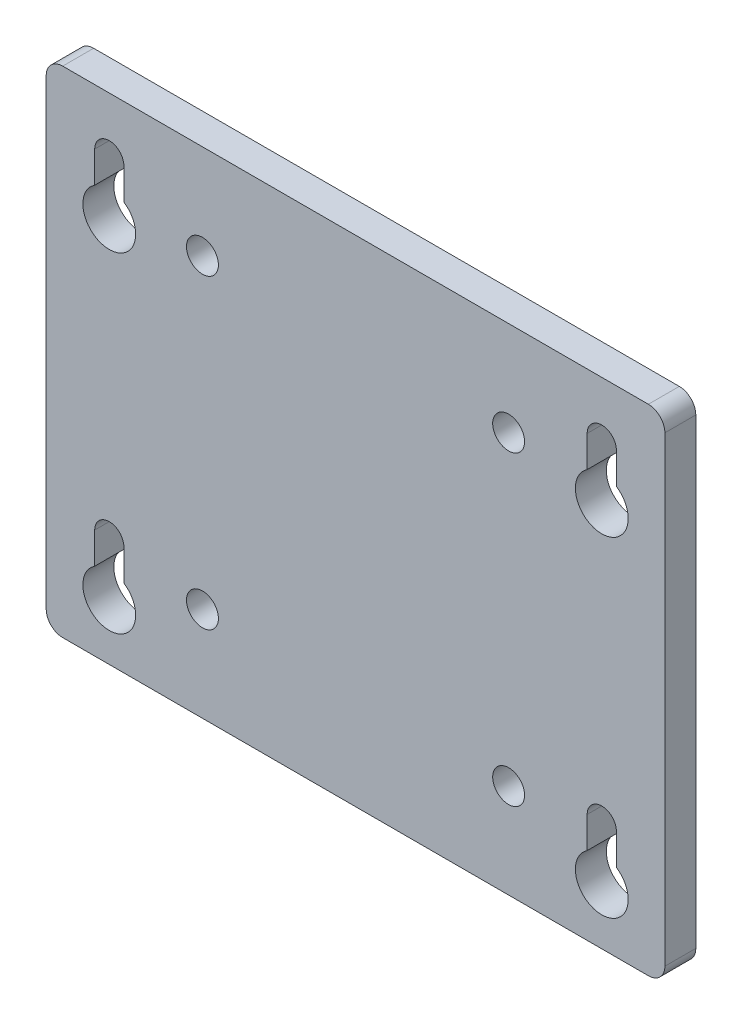
ISO-10303-21;
HEADER;
FILE_DESCRIPTION(('STEP AP214'),'2;1');
FILE_NAME('part.step','',(''),(''),'','','');
FILE_SCHEMA(('AUTOMOTIVE_DESIGN { 1 0 10303 214 1 1 1 1 }'));
ENDSEC;
DATA;
#1=APPLICATION_CONTEXT('core data for automotive mechanical design processes');
#2=APPLICATION_PROTOCOL_DEFINITION('international standard','automotive_design',2000,#1);
#3=PRODUCT_CONTEXT('',#1,'mechanical');
#4=PRODUCT('Part','Part','',(#3));
#5=PRODUCT_RELATED_PRODUCT_CATEGORY('part','',(#4));
#6=PRODUCT_DEFINITION_FORMATION('','',#4);
#7=PRODUCT_DEFINITION_CONTEXT('part definition',#1,'design');
#8=PRODUCT_DEFINITION('design','',#6,#7);
#9=PRODUCT_DEFINITION_SHAPE('','',#8);
#10=(LENGTH_UNIT() NAMED_UNIT(*) SI_UNIT(.MILLI.,.METRE.));
#11=(NAMED_UNIT(*) PLANE_ANGLE_UNIT() SI_UNIT($,.RADIAN.));
#12=(NAMED_UNIT(*) SI_UNIT($,.STERADIAN.) SOLID_ANGLE_UNIT());
#13=UNCERTAINTY_MEASURE_WITH_UNIT(LENGTH_MEASURE(1.E-05),#10,'distance_accuracy_value','');
#14=(GEOMETRIC_REPRESENTATION_CONTEXT(3) GLOBAL_UNCERTAINTY_ASSIGNED_CONTEXT((#13)) GLOBAL_UNIT_ASSIGNED_CONTEXT((#10,
#11,#12)) REPRESENTATION_CONTEXT('',''));
#15=CARTESIAN_POINT('',(0.,0.,0.));
#16=DIRECTION('',(0.,0.,1.));
#17=DIRECTION('',(1.,0.,0.));
#18=AXIS2_PLACEMENT_3D('',#15,#16,#17);
#19=CARTESIAN_POINT('',(0.,0.,0.));
#20=DIRECTION('',(0.,0.,1.));
#21=DIRECTION('',(1.,0.,0.));
#22=AXIS2_PLACEMENT_3D('',#19,#20,#21);
#23=PLANE('',#22);
#24=DIRECTION('',(0.,-1.,0.));
#25=VECTOR('',#24,1.);
#26=CARTESIAN_POINT('',(35.6646,29.5021,0.));
#27=LINE('',#26,#25);
#28=CARTESIAN_POINT('',(35.6646,29.5021,0.));
#29=VERTEX_POINT('',#28);
#30=CARTESIAN_POINT('',(35.6646,24.6836113861049,0.));
#31=VERTEX_POINT('',#30);
#32=EDGE_CURVE('E702',#29,#31,#27,.T.);
#33=ORIENTED_EDGE('',*,*,#32,.T.);
#34=CARTESIAN_POINT('',(37.9125,21.2979,0.));
#35=DIRECTION('',(0.,0.,-1.));
#36=DIRECTION('',(-1.,0.,0.));
#37=AXIS2_PLACEMENT_3D('',#34,#35,#36);
#38=CIRCLE('',#37,4.064);
#39=CARTESIAN_POINT('',(40.1604,24.6836113861049,0.));
#40=VERTEX_POINT('',#39);
#41=EDGE_CURVE('E685',#40,#31,#38,.T.);
#42=ORIENTED_EDGE('',*,*,#41,.F.);
#43=DIRECTION('',(0.,-1.,0.));
#44=VECTOR('',#43,1.);
#45=CARTESIAN_POINT('',(40.1604,29.5021,0.));
#46=LINE('',#45,#44);
#47=CARTESIAN_POINT('',(40.1604,29.5021,0.));
#48=VERTEX_POINT('',#47);
#49=EDGE_CURVE('E693',#48,#40,#46,.T.);
#50=ORIENTED_EDGE('',*,*,#49,.F.);
#51=CARTESIAN_POINT('',(37.9125,29.5021,0.));
#52=DIRECTION('',(0.,0.,-1.));
#53=DIRECTION('',(-1.,0.,0.));
#54=AXIS2_PLACEMENT_3D('',#51,#52,#53);
#55=CIRCLE('',#54,2.2479);
#56=EDGE_CURVE('E708',#29,#48,#55,.T.);
#57=ORIENTED_EDGE('',*,*,#56,.F.);
#58=EDGE_LOOP('',(#33,#42,#50,#57));
#59=FACE_BOUND('',#58,.T.);
#60=DIRECTION('',(0.,1.,0.));
#61=VECTOR('',#60,1.);
#62=CARTESIAN_POINT('',(47.625,-38.1,0.));
#63=LINE('',#62,#61);
#64=CARTESIAN_POINT('',(47.625,-35.56,0.));
#65=VERTEX_POINT('',#64);
#66=CARTESIAN_POINT('',(47.625,35.56,0.));
#67=VERTEX_POINT('',#66);
#68=EDGE_CURVE('E611',#65,#67,#63,.T.);
#69=ORIENTED_EDGE('',*,*,#68,.F.);
#70=CARTESIAN_POINT('',(45.085,-35.56,0.));
#71=DIRECTION('',(0.,0.,1.));
#72=DIRECTION('',(1.,0.,0.));
#73=AXIS2_PLACEMENT_3D('',#70,#71,#72);
#74=CIRCLE('',#73,2.54);
#75=CARTESIAN_POINT('',(45.085,-38.1,0.));
#76=VERTEX_POINT('',#75);
#77=EDGE_CURVE('E626',#65,#76,#74,.F.);
#78=ORIENTED_EDGE('',*,*,#77,.T.);
#79=DIRECTION('',(1.,0.,0.));
#80=VECTOR('',#79,1.);
#81=CARTESIAN_POINT('',(47.625,-38.1,0.));
#82=LINE('',#81,#80);
#83=CARTESIAN_POINT('',(-45.085,-38.1,0.));
#84=VERTEX_POINT('',#83);
#85=EDGE_CURVE('E608',#84,#76,#82,.T.);
#86=ORIENTED_EDGE('',*,*,#85,.F.);
#87=CARTESIAN_POINT('',(-45.085,-35.56,0.));
#88=DIRECTION('',(0.,0.,1.));
#89=DIRECTION('',(1.,0.,0.));
#90=AXIS2_PLACEMENT_3D('',#87,#88,#89);
#91=CIRCLE('',#90,2.54);
#92=CARTESIAN_POINT('',(-47.625,-35.56,0.));
#93=VERTEX_POINT('',#92);
#94=EDGE_CURVE('E624',#84,#93,#91,.F.);
#95=ORIENTED_EDGE('',*,*,#94,.T.);
#96=DIRECTION('',(0.,-1.,0.));
#97=VECTOR('',#96,1.);
#98=CARTESIAN_POINT('',(-47.625,-38.1,0.));
#99=LINE('',#98,#97);
#100=CARTESIAN_POINT('',(-47.625,35.56,0.));
#101=VERTEX_POINT('',#100);
#102=EDGE_CURVE('E591',#101,#93,#99,.T.);
#103=ORIENTED_EDGE('',*,*,#102,.F.);
#104=CARTESIAN_POINT('',(-45.085,35.56,0.));
#105=DIRECTION('',(0.,0.,1.));
#106=DIRECTION('',(1.,0.,0.));
#107=AXIS2_PLACEMENT_3D('',#104,#105,#106);
#108=CIRCLE('',#107,2.54);
#109=CARTESIAN_POINT('',(-45.085,38.1,0.));
#110=VERTEX_POINT('',#109);
#111=EDGE_CURVE('E622',#101,#110,#108,.F.);
#112=ORIENTED_EDGE('',*,*,#111,.T.);
#113=DIRECTION('',(-1.,0.,0.));
#114=VECTOR('',#113,1.);
#115=CARTESIAN_POINT('',(47.625,38.1,0.));
#116=LINE('',#115,#114);
#117=CARTESIAN_POINT('',(45.085,38.1,0.));
#118=VERTEX_POINT('',#117);
#119=EDGE_CURVE('E596',#118,#110,#116,.T.);
#120=ORIENTED_EDGE('',*,*,#119,.F.);
#121=CARTESIAN_POINT('',(45.085,35.56,0.));
#122=DIRECTION('',(0.,0.,1.));
#123=DIRECTION('',(1.,0.,0.));
#124=AXIS2_PLACEMENT_3D('',#121,#122,#123);
#125=CIRCLE('',#124,2.54);
#126=EDGE_CURVE('E620',#118,#67,#125,.F.);
#127=ORIENTED_EDGE('',*,*,#126,.T.);
#128=EDGE_LOOP('',(#69,#78,#86,#95,#103,#112,#120,#127));
#129=FACE_BOUND('',#128,.T.);
#130=CARTESIAN_POINT('',(23.57,-23.57,0.));
#131=DIRECTION('',(0.,0.,1.));
#132=DIRECTION('',(1.,0.,0.));
#133=AXIS2_PLACEMENT_3D('',#130,#131,#132);
#134=CIRCLE('',#133,2.45745);
#135=CARTESIAN_POINT('',(26.02745,-23.57,0.));
#136=VERTEX_POINT('',#135);
#137=EDGE_CURVE('E588',#136,#136,#134,.T.);
#138=ORIENTED_EDGE('',*,*,#137,.T.);
#139=EDGE_LOOP('',(#138));
#140=FACE_BOUND('',#139,.T.);
#141=CARTESIAN_POINT('',(-23.57,-23.57,0.));
#142=DIRECTION('',(0.,0.,1.));
#143=DIRECTION('',(1.,0.,0.));
#144=AXIS2_PLACEMENT_3D('',#141,#142,#143);
#145=CIRCLE('',#144,2.45745);
#146=CARTESIAN_POINT('',(-21.11255,-23.57,0.));
#147=VERTEX_POINT('',#146);
#148=EDGE_CURVE('E582',#147,#147,#145,.T.);
#149=ORIENTED_EDGE('',*,*,#148,.T.);
#150=EDGE_LOOP('',(#149));
#151=FACE_BOUND('',#150,.T.);
#152=CARTESIAN_POINT('',(-23.57,23.57,0.));
#153=DIRECTION('',(0.,0.,1.));
#154=DIRECTION('',(1.,0.,0.));
#155=AXIS2_PLACEMENT_3D('',#152,#153,#154);
#156=CIRCLE('',#155,2.45745);
#157=CARTESIAN_POINT('',(-21.11255,23.57,0.));
#158=VERTEX_POINT('',#157);
#159=EDGE_CURVE('E576',#158,#158,#156,.T.);
#160=ORIENTED_EDGE('',*,*,#159,.T.);
#161=EDGE_LOOP('',(#160));
#162=FACE_BOUND('',#161,.T.);
#163=CARTESIAN_POINT('',(23.57,23.57,0.));
#164=DIRECTION('',(0.,0.,1.));
#165=DIRECTION('',(1.,0.,0.));
#166=AXIS2_PLACEMENT_3D('',#163,#164,#165);
#167=CIRCLE('',#166,2.45745);
#168=CARTESIAN_POINT('',(26.02745,23.57,0.));
#169=VERTEX_POINT('',#168);
#170=EDGE_CURVE('E570',#169,#169,#167,.T.);
#171=ORIENTED_EDGE('',*,*,#170,.T.);
#172=EDGE_LOOP('',(#171));
#173=FACE_BOUND('',#172,.T.);
#174=DIRECTION('',(0.,-1.,0.));
#175=VECTOR('',#174,1.);
#176=CARTESIAN_POINT('',(-40.1604,29.5021,0.));
#177=LINE('',#176,#175);
#178=CARTESIAN_POINT('',(-40.1604,29.5021,0.));
#179=VERTEX_POINT('',#178);
#180=CARTESIAN_POINT('',(-40.1604,24.6836113861049,0.));
#181=VERTEX_POINT('',#180);
#182=EDGE_CURVE('E553',#179,#181,#177,.T.);
#183=ORIENTED_EDGE('',*,*,#182,.T.);
#184=CARTESIAN_POINT('',(-37.9125,21.2979,0.));
#185=DIRECTION('',(0.,0.,-1.));
#186=DIRECTION('',(1.,0.,0.));
#187=AXIS2_PLACEMENT_3D('',#184,#185,#186);
#188=CIRCLE('',#187,4.064);
#189=CARTESIAN_POINT('',(-35.6646,24.6836113861049,0.));
#190=VERTEX_POINT('',#189);
#191=EDGE_CURVE('E504',#190,#181,#188,.T.);
#192=ORIENTED_EDGE('',*,*,#191,.F.);
#193=DIRECTION('',(0.,-1.,0.));
#194=VECTOR('',#193,1.);
#195=CARTESIAN_POINT('',(-35.6646,29.5021,0.));
#196=LINE('',#195,#194);
#197=CARTESIAN_POINT('',(-35.6646,29.5021,0.));
#198=VERTEX_POINT('',#197);
#199=EDGE_CURVE('E544',#198,#190,#196,.T.);
#200=ORIENTED_EDGE('',*,*,#199,.F.);
#201=CARTESIAN_POINT('',(-37.9125,29.5021,0.));
#202=DIRECTION('',(0.,0.,-1.));
#203=DIRECTION('',(-1.,0.,0.));
#204=AXIS2_PLACEMENT_3D('',#201,#202,#203);
#205=CIRCLE('',#204,2.2479);
#206=EDGE_CURVE('E559',#179,#198,#205,.T.);
#207=ORIENTED_EDGE('',*,*,#206,.F.);
#208=EDGE_LOOP('',(#183,#192,#200,#207));
#209=FACE_BOUND('',#208,.T.);
#210=DIRECTION('',(0.,-1.,0.));
#211=VECTOR('',#210,1.);
#212=CARTESIAN_POINT('',(-40.1604,-21.2979,0.));
#213=LINE('',#212,#211);
#214=CARTESIAN_POINT('',(-40.1604,-21.2979,0.));
#215=VERTEX_POINT('',#214);
#216=CARTESIAN_POINT('',(-40.1604,-26.1163886138951,0.));
#217=VERTEX_POINT('',#216);
#218=EDGE_CURVE('E530',#215,#217,#213,.T.);
#219=ORIENTED_EDGE('',*,*,#218,.T.);
#220=CARTESIAN_POINT('',(-37.9125,-29.5021,0.));
#221=DIRECTION('',(0.,0.,-1.));
#222=DIRECTION('',(-1.,0.,0.));
#223=AXIS2_PLACEMENT_3D('',#220,#221,#222);
#224=CIRCLE('',#223,4.06400000000001);
#225=CARTESIAN_POINT('',(-35.6646,-26.1163886138952,0.));
#226=VERTEX_POINT('',#225);
#227=EDGE_CURVE('E677',#226,#217,#224,.T.);
#228=ORIENTED_EDGE('',*,*,#227,.F.);
#229=DIRECTION('',(0.,-1.,0.));
#230=VECTOR('',#229,1.);
#231=CARTESIAN_POINT('',(-35.6646,-21.2979,0.));
#232=LINE('',#231,#230);
#233=CARTESIAN_POINT('',(-35.6646,-21.2979,0.));
#234=VERTEX_POINT('',#233);
#235=EDGE_CURVE('E521',#234,#226,#232,.T.);
#236=ORIENTED_EDGE('',*,*,#235,.F.);
#237=CARTESIAN_POINT('',(-37.9125,-21.2979,0.));
#238=DIRECTION('',(0.,0.,-1.));
#239=DIRECTION('',(-1.,0.,0.));
#240=AXIS2_PLACEMENT_3D('',#237,#238,#239);
#241=CIRCLE('',#240,2.2479);
#242=EDGE_CURVE('E536',#215,#234,#241,.T.);
#243=ORIENTED_EDGE('',*,*,#242,.F.);
#244=EDGE_LOOP('',(#219,#228,#236,#243));
#245=FACE_BOUND('',#244,.T.);
#246=DIRECTION('',(0.,-1.,0.));
#247=VECTOR('',#246,1.);
#248=CARTESIAN_POINT('',(35.6646,-21.2979,0.));
#249=LINE('',#248,#247);
#250=CARTESIAN_POINT('',(35.6646,-21.2979,0.));
#251=VERTEX_POINT('',#250);
#252=CARTESIAN_POINT('',(35.6646,-26.1163886138952,0.));
#253=VERTEX_POINT('',#252);
#254=EDGE_CURVE('E500',#251,#253,#249,.T.);
#255=ORIENTED_EDGE('',*,*,#254,.T.);
#256=CARTESIAN_POINT('',(37.9125,-29.5021,0.));
#257=DIRECTION('',(0.,0.,-1.));
#258=DIRECTION('',(1.,0.,0.));
#259=AXIS2_PLACEMENT_3D('',#256,#257,#258);
#260=CIRCLE('',#259,4.06400000000001);
#261=CARTESIAN_POINT('',(40.1604,-26.1163886138952,0.));
#262=VERTEX_POINT('',#261);
#263=EDGE_CURVE('E487',#262,#253,#260,.T.);
#264=ORIENTED_EDGE('',*,*,#263,.F.);
#265=DIRECTION('',(0.,-1.,0.));
#266=VECTOR('',#265,1.);
#267=CARTESIAN_POINT('',(40.1604,-21.2979,0.));
#268=LINE('',#267,#266);
#269=CARTESIAN_POINT('',(40.1604,-21.2979,0.));
#270=VERTEX_POINT('',#269);
#271=EDGE_CURVE('E716',#270,#262,#268,.T.);
#272=ORIENTED_EDGE('',*,*,#271,.F.);
#273=CARTESIAN_POINT('',(37.9125,-21.2979,0.));
#274=DIRECTION('',(0.,0.,-1.));
#275=DIRECTION('',(-1.,0.,0.));
#276=AXIS2_PLACEMENT_3D('',#273,#274,#275);
#277=CIRCLE('',#276,2.2479);
#278=EDGE_CURVE('E506',#251,#270,#277,.T.);
#279=ORIENTED_EDGE('',*,*,#278,.F.);
#280=EDGE_LOOP('',(#255,#264,#272,#279));
#281=FACE_BOUND('',#280,.T.);
#282=ADVANCED_FACE('F329',(#59,#129,#140,#151,#162,#173,#209,#245,#281),#23,.F.);
#283=CARTESIAN_POINT('',(-47.625,-38.1,4.7625));
#284=DIRECTION('',(1.,0.,0.));
#285=DIRECTION('',(0.,0.,-1.));
#286=AXIS2_PLACEMENT_3D('',#283,#284,#285);
#287=PLANE('',#286);
#288=ORIENTED_EDGE('',*,*,#102,.T.);
#289=DIRECTION('',(0.,0.,-1.));
#290=VECTOR('',#289,1.);
#291=CARTESIAN_POINT('',(-47.625,-35.56,4.7625));
#292=LINE('',#291,#290);
#293=CARTESIAN_POINT('',(-47.625,-35.56,4.7625));
#294=VERTEX_POINT('',#293);
#295=EDGE_CURVE('E644',#93,#294,#292,.F.);
#296=ORIENTED_EDGE('',*,*,#295,.T.);
#297=DIRECTION('',(0.,-1.,0.));
#298=VECTOR('',#297,1.);
#299=CARTESIAN_POINT('',(-47.625,-38.1,4.7625));
#300=LINE('',#299,#298);
#301=CARTESIAN_POINT('',(-47.625,35.56,4.7625));
#302=VERTEX_POINT('',#301);
#303=EDGE_CURVE('E592',#302,#294,#300,.T.);
#304=ORIENTED_EDGE('',*,*,#303,.F.);
#305=DIRECTION('',(0.,0.,-1.));
#306=VECTOR('',#305,1.);
#307=CARTESIAN_POINT('',(-47.625,35.56,4.7625));
#308=LINE('',#307,#306);
#309=EDGE_CURVE('E641',#302,#101,#308,.T.);
#310=ORIENTED_EDGE('',*,*,#309,.T.);
#311=EDGE_LOOP('',(#288,#296,#304,#310));
#312=FACE_BOUND('',#311,.T.);
#313=ADVANCED_FACE('F737',(#312),#287,.F.);
#314=CARTESIAN_POINT('',(47.625,-38.1,4.7625));
#315=DIRECTION('',(0.,1.,0.));
#316=DIRECTION('',(-1.,0.,0.));
#317=AXIS2_PLACEMENT_3D('',#314,#315,#316);
#318=PLANE('',#317);
#319=ORIENTED_EDGE('',*,*,#85,.T.);
#320=DIRECTION('',(0.,0.,-1.));
#321=VECTOR('',#320,1.);
#322=CARTESIAN_POINT('',(45.085,-38.1,4.7625));
#323=LINE('',#322,#321);
#324=CARTESIAN_POINT('',(45.085,-38.1,4.7625));
#325=VERTEX_POINT('',#324);
#326=EDGE_CURVE('E631',#76,#325,#323,.F.);
#327=ORIENTED_EDGE('',*,*,#326,.T.);
#328=DIRECTION('',(1.,0.,0.));
#329=VECTOR('',#328,1.);
#330=CARTESIAN_POINT('',(47.625,-38.1,4.7625));
#331=LINE('',#330,#329);
#332=CARTESIAN_POINT('',(-45.085,-38.1,4.7625));
#333=VERTEX_POINT('',#332);
#334=EDGE_CURVE('E595',#333,#325,#331,.T.);
#335=ORIENTED_EDGE('',*,*,#334,.F.);
#336=DIRECTION('',(0.,0.,-1.));
#337=VECTOR('',#336,1.);
#338=CARTESIAN_POINT('',(-45.085,-38.1,4.7625));
#339=LINE('',#338,#337);
#340=EDGE_CURVE('E628',#333,#84,#339,.T.);
#341=ORIENTED_EDGE('',*,*,#340,.T.);
#342=EDGE_LOOP('',(#319,#327,#335,#341));
#343=FACE_BOUND('',#342,.T.);
#344=ADVANCED_FACE('F743',(#343),#318,.F.);
#345=CARTESIAN_POINT('',(47.625,-38.1,4.7625));
#346=DIRECTION('',(-1.,0.,0.));
#347=DIRECTION('',(0.,0.,1.));
#348=AXIS2_PLACEMENT_3D('',#345,#346,#347);
#349=PLANE('',#348);
#350=DIRECTION('',(0.,1.,0.));
#351=VECTOR('',#350,1.);
#352=CARTESIAN_POINT('',(47.625,-38.1,4.7625));
#353=LINE('',#352,#351);
#354=CARTESIAN_POINT('',(47.625,-35.56,4.7625));
#355=VERTEX_POINT('',#354);
#356=CARTESIAN_POINT('',(47.625,35.56,4.7625));
#357=VERTEX_POINT('',#356);
#358=EDGE_CURVE('E599',#355,#357,#353,.T.);
#359=ORIENTED_EDGE('',*,*,#358,.F.);
#360=DIRECTION('',(0.,0.,-1.));
#361=VECTOR('',#360,1.);
#362=CARTESIAN_POINT('',(47.625,-35.56,4.7625));
#363=LINE('',#362,#361);
#364=EDGE_CURVE('E617',#355,#65,#363,.T.);
#365=ORIENTED_EDGE('',*,*,#364,.T.);
#366=ORIENTED_EDGE('',*,*,#68,.T.);
#367=DIRECTION('',(0.,0.,-1.));
#368=VECTOR('',#367,1.);
#369=CARTESIAN_POINT('',(47.625,35.56,4.7625));
#370=LINE('',#369,#368);
#371=EDGE_CURVE('E605',#67,#357,#370,.F.);
#372=ORIENTED_EDGE('',*,*,#371,.T.);
#373=EDGE_LOOP('',(#359,#365,#366,#372));
#374=FACE_BOUND('',#373,.T.);
#375=ADVANCED_FACE('F753',(#374),#349,.F.);
#376=CARTESIAN_POINT('',(47.625,38.1,4.7625));
#377=DIRECTION('',(0.,-1.,0.));
#378=DIRECTION('',(1.,0.,0.));
#379=AXIS2_PLACEMENT_3D('',#376,#377,#378);
#380=PLANE('',#379);
#381=ORIENTED_EDGE('',*,*,#119,.T.);
#382=DIRECTION('',(0.,0.,-1.));
#383=VECTOR('',#382,1.);
#384=CARTESIAN_POINT('',(-45.085,38.1,4.7625));
#385=LINE('',#384,#383);
#386=CARTESIAN_POINT('',(-45.085,38.1,4.7625));
#387=VERTEX_POINT('',#386);
#388=EDGE_CURVE('E649',#110,#387,#385,.F.);
#389=ORIENTED_EDGE('',*,*,#388,.T.);
#390=DIRECTION('',(-1.,0.,0.));
#391=VECTOR('',#390,1.);
#392=CARTESIAN_POINT('',(47.625,38.1,4.7625));
#393=LINE('',#392,#391);
#394=CARTESIAN_POINT('',(45.085,38.1,4.7625));
#395=VERTEX_POINT('',#394);
#396=EDGE_CURVE('E602',#395,#387,#393,.T.);
#397=ORIENTED_EDGE('',*,*,#396,.F.);
#398=DIRECTION('',(0.,0.,-1.));
#399=VECTOR('',#398,1.);
#400=CARTESIAN_POINT('',(45.085,38.1,4.7625));
#401=LINE('',#400,#399);
#402=EDGE_CURVE('E646',#395,#118,#401,.T.);
#403=ORIENTED_EDGE('',*,*,#402,.T.);
#404=EDGE_LOOP('',(#381,#389,#397,#403));
#405=FACE_BOUND('',#404,.T.);
#406=ADVANCED_FACE('F750',(#405),#380,.F.);
#407=CARTESIAN_POINT('',(0.,0.,4.7625));
#408=DIRECTION('',(0.,0.,1.));
#409=DIRECTION('',(1.,0.,0.));
#410=AXIS2_PLACEMENT_3D('',#407,#408,#409);
#411=PLANE('',#410);
#412=CARTESIAN_POINT('',(37.9125,-29.5021,4.7625));
#413=DIRECTION('',(0.,0.,-1.));
#414=DIRECTION('',(1.,0.,0.));
#415=AXIS2_PLACEMENT_3D('',#412,#413,#414);
#416=CIRCLE('',#415,4.06400000000001);
#417=CARTESIAN_POINT('',(40.1604,-26.1163886138952,4.7625));
#418=VERTEX_POINT('',#417);
#419=CARTESIAN_POINT('',(35.6646,-26.1163886138952,4.7625));
#420=VERTEX_POINT('',#419);
#421=EDGE_CURVE('E344',#418,#420,#416,.T.);
#422=ORIENTED_EDGE('',*,*,#421,.T.);
#423=DIRECTION('',(0.,-1.,0.));
#424=VECTOR('',#423,1.);
#425=CARTESIAN_POINT('',(35.6646,-21.2979,4.7625));
#426=LINE('',#425,#424);
#427=CARTESIAN_POINT('',(35.6646,-21.2979,4.7625));
#428=VERTEX_POINT('',#427);
#429=EDGE_CURVE('E503',#428,#420,#426,.T.);
#430=ORIENTED_EDGE('',*,*,#429,.F.);
#431=CARTESIAN_POINT('',(37.9125,-21.2979,4.7625));
#432=DIRECTION('',(0.,0.,-1.));
#433=DIRECTION('',(-1.,0.,0.));
#434=AXIS2_PLACEMENT_3D('',#431,#432,#433);
#435=CIRCLE('',#434,2.2479);
#436=CARTESIAN_POINT('',(40.1604,-21.2979,4.7625));
#437=VERTEX_POINT('',#436);
#438=EDGE_CURVE('E516',#428,#437,#435,.T.);
#439=ORIENTED_EDGE('',*,*,#438,.T.);
#440=DIRECTION('',(0.,-1.,0.));
#441=VECTOR('',#440,1.);
#442=CARTESIAN_POINT('',(40.1604,-21.2979,4.7625));
#443=LINE('',#442,#441);
#444=EDGE_CURVE('E511',#437,#418,#443,.T.);
#445=ORIENTED_EDGE('',*,*,#444,.T.);
#446=EDGE_LOOP('',(#422,#430,#439,#445));
#447=FACE_BOUND('',#446,.T.);
#448=CARTESIAN_POINT('',(-37.9125,21.2979,4.7625));
#449=DIRECTION('',(0.,0.,-1.));
#450=DIRECTION('',(1.,0.,0.));
#451=AXIS2_PLACEMENT_3D('',#448,#449,#450);
#452=CIRCLE('',#451,4.064);
#453=CARTESIAN_POINT('',(-35.6646,24.6836113861049,4.7625));
#454=VERTEX_POINT('',#453);
#455=CARTESIAN_POINT('',(-40.1604,24.6836113861049,4.7625));
#456=VERTEX_POINT('',#455);
#457=EDGE_CURVE('E351',#454,#456,#452,.T.);
#458=ORIENTED_EDGE('',*,*,#457,.T.);
#459=DIRECTION('',(0.,-1.,0.));
#460=VECTOR('',#459,1.);
#461=CARTESIAN_POINT('',(-40.1604,29.5021,4.7625));
#462=LINE('',#461,#460);
#463=CARTESIAN_POINT('',(-40.1604,29.5021,4.7625));
#464=VERTEX_POINT('',#463);
#465=EDGE_CURVE('E550',#464,#456,#462,.T.);
#466=ORIENTED_EDGE('',*,*,#465,.F.);
#467=CARTESIAN_POINT('',(-37.9125,29.5021,4.7625));
#468=DIRECTION('',(0.,0.,-1.));
#469=DIRECTION('',(-1.,0.,0.));
#470=AXIS2_PLACEMENT_3D('',#467,#468,#469);
#471=CIRCLE('',#470,2.2479);
#472=CARTESIAN_POINT('',(-35.6646,29.5021,4.7625));
#473=VERTEX_POINT('',#472);
#474=EDGE_CURVE('E562',#464,#473,#471,.T.);
#475=ORIENTED_EDGE('',*,*,#474,.T.);
#476=DIRECTION('',(0.,-1.,0.));
#477=VECTOR('',#476,1.);
#478=CARTESIAN_POINT('',(-35.6646,29.5021,4.7625));
#479=LINE('',#478,#477);
#480=EDGE_CURVE('E547',#473,#454,#479,.T.);
#481=ORIENTED_EDGE('',*,*,#480,.T.);
#482=EDGE_LOOP('',(#458,#466,#475,#481));
#483=FACE_BOUND('',#482,.T.);
#484=CARTESIAN_POINT('',(-37.9125,-29.5021,4.7625));
#485=DIRECTION('',(0.,0.,-1.));
#486=DIRECTION('',(-1.,0.,0.));
#487=AXIS2_PLACEMENT_3D('',#484,#485,#486);
#488=CIRCLE('',#487,4.06400000000001);
#489=CARTESIAN_POINT('',(-35.6646,-26.1163886138952,4.7625));
#490=VERTEX_POINT('',#489);
#491=CARTESIAN_POINT('',(-40.1604,-26.1163886138951,4.7625));
#492=VERTEX_POINT('',#491);
#493=EDGE_CURVE('E678',#490,#492,#488,.T.);
#494=ORIENTED_EDGE('',*,*,#493,.T.);
#495=DIRECTION('',(0.,-1.,0.));
#496=VECTOR('',#495,1.);
#497=CARTESIAN_POINT('',(-40.1604,-21.2979,4.7625));
#498=LINE('',#497,#496);
#499=CARTESIAN_POINT('',(-40.1604,-21.2979,4.7625));
#500=VERTEX_POINT('',#499);
#501=EDGE_CURVE('E527',#500,#492,#498,.T.);
#502=ORIENTED_EDGE('',*,*,#501,.F.);
#503=CARTESIAN_POINT('',(-37.9125,-21.2979,4.7625));
#504=DIRECTION('',(0.,0.,-1.));
#505=DIRECTION('',(-1.,0.,0.));
#506=AXIS2_PLACEMENT_3D('',#503,#504,#505);
#507=CIRCLE('',#506,2.2479);
#508=CARTESIAN_POINT('',(-35.6646,-21.2979,4.7625));
#509=VERTEX_POINT('',#508);
#510=EDGE_CURVE('E539',#500,#509,#507,.T.);
#511=ORIENTED_EDGE('',*,*,#510,.T.);
#512=DIRECTION('',(0.,-1.,0.));
#513=VECTOR('',#512,1.);
#514=CARTESIAN_POINT('',(-35.6646,-21.2979,4.7625));
#515=LINE('',#514,#513);
#516=EDGE_CURVE('E524',#509,#490,#515,.T.);
#517=ORIENTED_EDGE('',*,*,#516,.T.);
#518=EDGE_LOOP('',(#494,#502,#511,#517));
#519=FACE_BOUND('',#518,.T.);
#520=CARTESIAN_POINT('',(37.9125,21.2979,4.7625));
#521=DIRECTION('',(0.,0.,-1.));
#522=DIRECTION('',(-1.,0.,0.));
#523=AXIS2_PLACEMENT_3D('',#520,#521,#522);
#524=CIRCLE('',#523,4.064);
#525=CARTESIAN_POINT('',(40.1604,24.6836113861049,4.7625));
#526=VERTEX_POINT('',#525);
#527=CARTESIAN_POINT('',(35.6646,24.6836113861049,4.7625));
#528=VERTEX_POINT('',#527);
#529=EDGE_CURVE('E686',#526,#528,#524,.T.);
#530=ORIENTED_EDGE('',*,*,#529,.T.);
#531=DIRECTION('',(0.,-1.,0.));
#532=VECTOR('',#531,1.);
#533=CARTESIAN_POINT('',(35.6646,29.5021,4.7625));
#534=LINE('',#533,#532);
#535=CARTESIAN_POINT('',(35.6646,29.5021,4.7625));
#536=VERTEX_POINT('',#535);
#537=EDGE_CURVE('E699',#536,#528,#534,.T.);
#538=ORIENTED_EDGE('',*,*,#537,.F.);
#539=CARTESIAN_POINT('',(37.9125,29.5021,4.7625));
#540=DIRECTION('',(0.,0.,-1.));
#541=DIRECTION('',(-1.,0.,0.));
#542=AXIS2_PLACEMENT_3D('',#539,#540,#541);
#543=CIRCLE('',#542,2.2479);
#544=CARTESIAN_POINT('',(40.1604,29.5021,4.7625));
#545=VERTEX_POINT('',#544);
#546=EDGE_CURVE('E711',#536,#545,#543,.T.);
#547=ORIENTED_EDGE('',*,*,#546,.T.);
#548=DIRECTION('',(0.,-1.,0.));
#549=VECTOR('',#548,1.);
#550=CARTESIAN_POINT('',(40.1604,29.5021,4.7625));
#551=LINE('',#550,#549);
#552=EDGE_CURVE('E696',#545,#526,#551,.T.);
#553=ORIENTED_EDGE('',*,*,#552,.T.);
#554=EDGE_LOOP('',(#530,#538,#547,#553));
#555=FACE_BOUND('',#554,.T.);
#556=CARTESIAN_POINT('',(23.57,23.57,4.7625));
#557=DIRECTION('',(0.,0.,1.));
#558=DIRECTION('',(1.,0.,0.));
#559=AXIS2_PLACEMENT_3D('',#556,#557,#558);
#560=CIRCLE('',#559,2.45745);
#561=CARTESIAN_POINT('',(26.02745,23.57,4.7625));
#562=VERTEX_POINT('',#561);
#563=EDGE_CURVE('E567',#562,#562,#560,.T.);
#564=ORIENTED_EDGE('',*,*,#563,.F.);
#565=EDGE_LOOP('',(#564));
#566=FACE_BOUND('',#565,.T.);
#567=CARTESIAN_POINT('',(-23.57,23.57,4.7625));
#568=DIRECTION('',(0.,0.,1.));
#569=DIRECTION('',(1.,0.,0.));
#570=AXIS2_PLACEMENT_3D('',#567,#568,#569);
#571=CIRCLE('',#570,2.45745);
#572=CARTESIAN_POINT('',(-21.11255,23.57,4.7625));
#573=VERTEX_POINT('',#572);
#574=EDGE_CURVE('E573',#573,#573,#571,.T.);
#575=ORIENTED_EDGE('',*,*,#574,.F.);
#576=EDGE_LOOP('',(#575));
#577=FACE_BOUND('',#576,.T.);
#578=CARTESIAN_POINT('',(-23.57,-23.57,4.7625));
#579=DIRECTION('',(0.,0.,1.));
#580=DIRECTION('',(1.,0.,0.));
#581=AXIS2_PLACEMENT_3D('',#578,#579,#580);
#582=CIRCLE('',#581,2.45745);
#583=CARTESIAN_POINT('',(-21.11255,-23.57,4.7625));
#584=VERTEX_POINT('',#583);
#585=EDGE_CURVE('E579',#584,#584,#582,.T.);
#586=ORIENTED_EDGE('',*,*,#585,.F.);
#587=EDGE_LOOP('',(#586));
#588=FACE_BOUND('',#587,.T.);
#589=CARTESIAN_POINT('',(23.57,-23.57,4.7625));
#590=DIRECTION('',(0.,0.,1.));
#591=DIRECTION('',(1.,0.,0.));
#592=AXIS2_PLACEMENT_3D('',#589,#590,#591);
#593=CIRCLE('',#592,2.45745);
#594=CARTESIAN_POINT('',(26.02745,-23.57,4.7625));
#595=VERTEX_POINT('',#594);
#596=EDGE_CURVE('E585',#595,#595,#593,.T.);
#597=ORIENTED_EDGE('',*,*,#596,.F.);
#598=EDGE_LOOP('',(#597));
#599=FACE_BOUND('',#598,.T.);
#600=ORIENTED_EDGE('',*,*,#334,.T.);
#601=CARTESIAN_POINT('',(45.085,-35.56,4.7625));
#602=DIRECTION('',(0.,0.,1.));
#603=DIRECTION('',(1.,0.,0.));
#604=AXIS2_PLACEMENT_3D('',#601,#602,#603);
#605=CIRCLE('',#604,2.54);
#606=EDGE_CURVE('E639',#325,#355,#605,.T.);
#607=ORIENTED_EDGE('',*,*,#606,.T.);
#608=ORIENTED_EDGE('',*,*,#358,.T.);
#609=CARTESIAN_POINT('',(45.085,35.56,4.7625));
#610=DIRECTION('',(0.,0.,1.));
#611=DIRECTION('',(1.,0.,0.));
#612=AXIS2_PLACEMENT_3D('',#609,#610,#611);
#613=CIRCLE('',#612,2.54);
#614=EDGE_CURVE('E633',#357,#395,#613,.T.);
#615=ORIENTED_EDGE('',*,*,#614,.T.);
#616=ORIENTED_EDGE('',*,*,#396,.T.);
#617=CARTESIAN_POINT('',(-45.085,35.56,4.7625));
#618=DIRECTION('',(0.,0.,1.));
#619=DIRECTION('',(1.,0.,0.));
#620=AXIS2_PLACEMENT_3D('',#617,#618,#619);
#621=CIRCLE('',#620,2.54);
#622=EDGE_CURVE('E635',#387,#302,#621,.T.);
#623=ORIENTED_EDGE('',*,*,#622,.T.);
#624=ORIENTED_EDGE('',*,*,#303,.T.);
#625=CARTESIAN_POINT('',(-45.085,-35.56,4.7625));
#626=DIRECTION('',(0.,0.,1.));
#627=DIRECTION('',(1.,0.,0.));
#628=AXIS2_PLACEMENT_3D('',#625,#626,#627);
#629=CIRCLE('',#628,2.54);
#630=EDGE_CURVE('E637',#294,#333,#629,.T.);
#631=ORIENTED_EDGE('',*,*,#630,.T.);
#632=EDGE_LOOP('',(#600,#607,#608,#615,#616,#623,#624,#631));
#633=FACE_BOUND('',#632,.T.);
#634=ADVANCED_FACE('F661',(#447,#483,#519,#555,#566,#577,#588,#599,#633),#411,.T.);
#635=CARTESIAN_POINT('',(23.57,-23.57,4.7625));
#636=DIRECTION('',(0.,0.,1.));
#637=DIRECTION('',(1.,0.,0.));
#638=AXIS2_PLACEMENT_3D('',#635,#636,#637);
#639=CYLINDRICAL_SURFACE('',#638,2.45745);
#640=ORIENTED_EDGE('',*,*,#137,.F.);
#641=EDGE_LOOP('',(#640));
#642=FACE_BOUND('',#641,.T.);
#643=ORIENTED_EDGE('',*,*,#596,.T.);
#644=EDGE_LOOP('',(#643));
#645=FACE_BOUND('',#644,.T.);
#646=ADVANCED_FACE('F814',(#642,#645),#639,.F.);
#647=CARTESIAN_POINT('',(-23.57,-23.57,4.7625));
#648=DIRECTION('',(0.,0.,1.));
#649=DIRECTION('',(1.,0.,0.));
#650=AXIS2_PLACEMENT_3D('',#647,#648,#649);
#651=CYLINDRICAL_SURFACE('',#650,2.45745);
#652=ORIENTED_EDGE('',*,*,#148,.F.);
#653=EDGE_LOOP('',(#652));
#654=FACE_BOUND('',#653,.T.);
#655=ORIENTED_EDGE('',*,*,#585,.T.);
#656=EDGE_LOOP('',(#655));
#657=FACE_BOUND('',#656,.T.);
#658=ADVANCED_FACE('F822',(#654,#657),#651,.F.);
#659=CARTESIAN_POINT('',(-23.57,23.57,4.7625));
#660=DIRECTION('',(0.,0.,1.));
#661=DIRECTION('',(1.,0.,0.));
#662=AXIS2_PLACEMENT_3D('',#659,#660,#661);
#663=CYLINDRICAL_SURFACE('',#662,2.45745);
#664=ORIENTED_EDGE('',*,*,#159,.F.);
#665=EDGE_LOOP('',(#664));
#666=FACE_BOUND('',#665,.T.);
#667=ORIENTED_EDGE('',*,*,#574,.T.);
#668=EDGE_LOOP('',(#667));
#669=FACE_BOUND('',#668,.T.);
#670=ADVANCED_FACE('F808',(#666,#669),#663,.F.);
#671=CARTESIAN_POINT('',(23.57,23.57,4.7625));
#672=DIRECTION('',(0.,0.,1.));
#673=DIRECTION('',(1.,0.,0.));
#674=AXIS2_PLACEMENT_3D('',#671,#672,#673);
#675=CYLINDRICAL_SURFACE('',#674,2.45745);
#676=ORIENTED_EDGE('',*,*,#170,.F.);
#677=EDGE_LOOP('',(#676));
#678=FACE_BOUND('',#677,.T.);
#679=ORIENTED_EDGE('',*,*,#563,.T.);
#680=EDGE_LOOP('',(#679));
#681=FACE_BOUND('',#680,.T.);
#682=ADVANCED_FACE('F765',(#678,#681),#675,.F.);
#683=CARTESIAN_POINT('',(45.085,-35.56,4.7625));
#684=DIRECTION('',(0.,0.,-1.));
#685=DIRECTION('',(-1.,0.,0.));
#686=AXIS2_PLACEMENT_3D('',#683,#684,#685);
#687=CYLINDRICAL_SURFACE('',#686,2.54);
#688=ORIENTED_EDGE('',*,*,#606,.F.);
#689=ORIENTED_EDGE('',*,*,#326,.F.);
#690=ORIENTED_EDGE('',*,*,#77,.F.);
#691=ORIENTED_EDGE('',*,*,#364,.F.);
#692=EDGE_LOOP('',(#688,#689,#690,#691));
#693=FACE_BOUND('',#692,.T.);
#694=ADVANCED_FACE('F761',(#693),#687,.T.);
#695=CARTESIAN_POINT('',(-45.085,-35.56,4.7625));
#696=DIRECTION('',(0.,0.,-1.));
#697=DIRECTION('',(-1.,0.,0.));
#698=AXIS2_PLACEMENT_3D('',#695,#696,#697);
#699=CYLINDRICAL_SURFACE('',#698,2.54);
#700=ORIENTED_EDGE('',*,*,#630,.F.);
#701=ORIENTED_EDGE('',*,*,#295,.F.);
#702=ORIENTED_EDGE('',*,*,#94,.F.);
#703=ORIENTED_EDGE('',*,*,#340,.F.);
#704=EDGE_LOOP('',(#700,#701,#702,#703));
#705=FACE_BOUND('',#704,.T.);
#706=ADVANCED_FACE('F764',(#705),#699,.T.);
#707=CARTESIAN_POINT('',(-45.085,35.56,4.7625));
#708=DIRECTION('',(0.,0.,-1.));
#709=DIRECTION('',(-1.,0.,0.));
#710=AXIS2_PLACEMENT_3D('',#707,#708,#709);
#711=CYLINDRICAL_SURFACE('',#710,2.54);
#712=ORIENTED_EDGE('',*,*,#622,.F.);
#713=ORIENTED_EDGE('',*,*,#388,.F.);
#714=ORIENTED_EDGE('',*,*,#111,.F.);
#715=ORIENTED_EDGE('',*,*,#309,.F.);
#716=EDGE_LOOP('',(#712,#713,#714,#715));
#717=FACE_BOUND('',#716,.T.);
#718=ADVANCED_FACE('F768',(#717),#711,.T.);
#719=CARTESIAN_POINT('',(45.085,35.56,4.7625));
#720=DIRECTION('',(0.,0.,-1.));
#721=DIRECTION('',(-1.,0.,0.));
#722=AXIS2_PLACEMENT_3D('',#719,#720,#721);
#723=CYLINDRICAL_SURFACE('',#722,2.54);
#724=ORIENTED_EDGE('',*,*,#614,.F.);
#725=ORIENTED_EDGE('',*,*,#371,.F.);
#726=ORIENTED_EDGE('',*,*,#126,.F.);
#727=ORIENTED_EDGE('',*,*,#402,.F.);
#728=EDGE_LOOP('',(#724,#725,#726,#727));
#729=FACE_BOUND('',#728,.T.);
#730=ADVANCED_FACE('F331',(#729),#723,.T.);
#731=CARTESIAN_POINT('',(-37.9125,29.5021,0.));
#732=DIRECTION('',(0.,0.,-1.));
#733=DIRECTION('',(-1.,0.,0.));
#734=AXIS2_PLACEMENT_3D('',#731,#732,#733);
#735=CYLINDRICAL_SURFACE('',#734,2.2479);
#736=ORIENTED_EDGE('',*,*,#206,.T.);
#737=DIRECTION('',(0.,0.,1.));
#738=VECTOR('',#737,1.);
#739=CARTESIAN_POINT('',(-35.6646,29.5021,4.7625));
#740=LINE('',#739,#738);
#741=EDGE_CURVE('E556',#198,#473,#740,.T.);
#742=ORIENTED_EDGE('',*,*,#741,.T.);
#743=ORIENTED_EDGE('',*,*,#474,.F.);
#744=DIRECTION('',(0.,0.,-1.));
#745=VECTOR('',#744,1.);
#746=CARTESIAN_POINT('',(-40.1604,29.5021,0.));
#747=LINE('',#746,#745);
#748=EDGE_CURVE('E565',#179,#464,#747,.F.);
#749=ORIENTED_EDGE('',*,*,#748,.F.);
#750=EDGE_LOOP('',(#736,#742,#743,#749));
#751=FACE_BOUND('',#750,.T.);
#752=ADVANCED_FACE('F667',(#751),#735,.F.);
#753=CARTESIAN_POINT('',(-40.1604,29.5021,0.));
#754=DIRECTION('',(-1.,0.,0.));
#755=DIRECTION('',(0.,0.,1.));
#756=AXIS2_PLACEMENT_3D('',#753,#754,#755);
#757=PLANE('',#756);
#758=ORIENTED_EDGE('',*,*,#465,.T.);
#759=DIRECTION('',(0.,0.,-1.));
#760=VECTOR('',#759,1.);
#761=CARTESIAN_POINT('',(-40.1604,24.6836113861049,4.7625));
#762=LINE('',#761,#760);
#763=EDGE_CURVE('E673',#456,#181,#762,.T.);
#764=ORIENTED_EDGE('',*,*,#763,.T.);
#765=ORIENTED_EDGE('',*,*,#182,.F.);
#766=ORIENTED_EDGE('',*,*,#748,.T.);
#767=EDGE_LOOP('',(#758,#764,#765,#766));
#768=FACE_BOUND('',#767,.T.);
#769=ADVANCED_FACE('F835',(#768),#757,.F.);
#770=CARTESIAN_POINT('',(-35.6646,29.5021,4.7625));
#771=DIRECTION('',(1.,0.,0.));
#772=DIRECTION('',(0.,0.,-1.));
#773=AXIS2_PLACEMENT_3D('',#770,#771,#772);
#774=PLANE('',#773);
#775=ORIENTED_EDGE('',*,*,#199,.T.);
#776=DIRECTION('',(0.,0.,-1.));
#777=VECTOR('',#776,1.);
#778=CARTESIAN_POINT('',(-35.6646,24.6836113861049,4.7625));
#779=LINE('',#778,#777);
#780=EDGE_CURVE('E337',#190,#454,#779,.F.);
#781=ORIENTED_EDGE('',*,*,#780,.T.);
#782=ORIENTED_EDGE('',*,*,#480,.F.);
#783=ORIENTED_EDGE('',*,*,#741,.F.);
#784=EDGE_LOOP('',(#775,#781,#782,#783));
#785=FACE_BOUND('',#784,.T.);
#786=ADVANCED_FACE('F657',(#785),#774,.F.);
#787=CARTESIAN_POINT('',(-37.9125,-21.2979,0.));
#788=DIRECTION('',(0.,0.,-1.));
#789=DIRECTION('',(-1.,0.,0.));
#790=AXIS2_PLACEMENT_3D('',#787,#788,#789);
#791=CYLINDRICAL_SURFACE('',#790,2.2479);
#792=ORIENTED_EDGE('',*,*,#242,.T.);
#793=DIRECTION('',(0.,0.,1.));
#794=VECTOR('',#793,1.);
#795=CARTESIAN_POINT('',(-35.6646,-21.2979,4.7625));
#796=LINE('',#795,#794);
#797=EDGE_CURVE('E533',#234,#509,#796,.T.);
#798=ORIENTED_EDGE('',*,*,#797,.T.);
#799=ORIENTED_EDGE('',*,*,#510,.F.);
#800=DIRECTION('',(0.,0.,-1.));
#801=VECTOR('',#800,1.);
#802=CARTESIAN_POINT('',(-40.1604,-21.2979,0.));
#803=LINE('',#802,#801);
#804=EDGE_CURVE('E542',#215,#500,#803,.F.);
#805=ORIENTED_EDGE('',*,*,#804,.F.);
#806=EDGE_LOOP('',(#792,#798,#799,#805));
#807=FACE_BOUND('',#806,.T.);
#808=ADVANCED_FACE('F841',(#807),#791,.F.);
#809=CARTESIAN_POINT('',(-40.1604,-21.2979,0.));
#810=DIRECTION('',(-1.,0.,0.));
#811=DIRECTION('',(0.,0.,1.));
#812=AXIS2_PLACEMENT_3D('',#809,#810,#811);
#813=PLANE('',#812);
#814=ORIENTED_EDGE('',*,*,#501,.T.);
#815=DIRECTION('',(0.,0.,-1.));
#816=VECTOR('',#815,1.);
#817=CARTESIAN_POINT('',(-40.1604,-26.1163886138951,4.7625));
#818=LINE('',#817,#816);
#819=EDGE_CURVE('E681',#492,#217,#818,.T.);
#820=ORIENTED_EDGE('',*,*,#819,.T.);
#821=ORIENTED_EDGE('',*,*,#218,.F.);
#822=ORIENTED_EDGE('',*,*,#804,.T.);
#823=EDGE_LOOP('',(#814,#820,#821,#822));
#824=FACE_BOUND('',#823,.T.);
#825=ADVANCED_FACE('F733',(#824),#813,.F.);
#826=CARTESIAN_POINT('',(-35.6646,-21.2979,4.7625));
#827=DIRECTION('',(1.,0.,0.));
#828=DIRECTION('',(0.,0.,-1.));
#829=AXIS2_PLACEMENT_3D('',#826,#827,#828);
#830=PLANE('',#829);
#831=ORIENTED_EDGE('',*,*,#235,.T.);
#832=DIRECTION('',(0.,0.,-1.));
#833=VECTOR('',#832,1.);
#834=CARTESIAN_POINT('',(-35.6646,-26.1163886138952,4.7625));
#835=LINE('',#834,#833);
#836=EDGE_CURVE('E654',#226,#490,#835,.F.);
#837=ORIENTED_EDGE('',*,*,#836,.T.);
#838=ORIENTED_EDGE('',*,*,#516,.F.);
#839=ORIENTED_EDGE('',*,*,#797,.F.);
#840=EDGE_LOOP('',(#831,#837,#838,#839));
#841=FACE_BOUND('',#840,.T.);
#842=ADVANCED_FACE('F726',(#841),#830,.F.);
#843=CARTESIAN_POINT('',(37.9125,-21.2979,0.));
#844=DIRECTION('',(0.,0.,-1.));
#845=DIRECTION('',(-1.,0.,0.));
#846=AXIS2_PLACEMENT_3D('',#843,#844,#845);
#847=CYLINDRICAL_SURFACE('',#846,2.2479);
#848=ORIENTED_EDGE('',*,*,#278,.T.);
#849=DIRECTION('',(0.,0.,1.));
#850=VECTOR('',#849,1.);
#851=CARTESIAN_POINT('',(40.1604,-21.2979,4.7625));
#852=LINE('',#851,#850);
#853=EDGE_CURVE('E507',#270,#437,#852,.T.);
#854=ORIENTED_EDGE('',*,*,#853,.T.);
#855=ORIENTED_EDGE('',*,*,#438,.F.);
#856=DIRECTION('',(0.,0.,-1.));
#857=VECTOR('',#856,1.);
#858=CARTESIAN_POINT('',(35.6646,-21.2979,0.));
#859=LINE('',#858,#857);
#860=EDGE_CURVE('E519',#251,#428,#859,.F.);
#861=ORIENTED_EDGE('',*,*,#860,.F.);
#862=EDGE_LOOP('',(#848,#854,#855,#861));
#863=FACE_BOUND('',#862,.T.);
#864=ADVANCED_FACE('F724',(#863),#847,.F.);
#865=CARTESIAN_POINT('',(35.6646,-21.2979,0.));
#866=DIRECTION('',(-1.,0.,0.));
#867=DIRECTION('',(0.,0.,1.));
#868=AXIS2_PLACEMENT_3D('',#865,#866,#867);
#869=PLANE('',#868);
#870=ORIENTED_EDGE('',*,*,#429,.T.);
#871=DIRECTION('',(0.,0.,-1.));
#872=VECTOR('',#871,1.);
#873=CARTESIAN_POINT('',(35.6646,-26.1163886138952,4.7625));
#874=LINE('',#873,#872);
#875=EDGE_CURVE('E490',#420,#253,#874,.T.);
#876=ORIENTED_EDGE('',*,*,#875,.T.);
#877=ORIENTED_EDGE('',*,*,#254,.F.);
#878=ORIENTED_EDGE('',*,*,#860,.T.);
#879=EDGE_LOOP('',(#870,#876,#877,#878));
#880=FACE_BOUND('',#879,.T.);
#881=ADVANCED_FACE('F499',(#880),#869,.F.);
#882=CARTESIAN_POINT('',(40.1604,-21.2979,4.7625));
#883=DIRECTION('',(1.,0.,0.));
#884=DIRECTION('',(0.,0.,-1.));
#885=AXIS2_PLACEMENT_3D('',#882,#883,#884);
#886=PLANE('',#885);
#887=ORIENTED_EDGE('',*,*,#271,.T.);
#888=DIRECTION('',(0.,0.,-1.));
#889=VECTOR('',#888,1.);
#890=CARTESIAN_POINT('',(40.1604,-26.1163886138952,4.7625));
#891=LINE('',#890,#889);
#892=EDGE_CURVE('E13',#262,#418,#891,.F.);
#893=ORIENTED_EDGE('',*,*,#892,.T.);
#894=ORIENTED_EDGE('',*,*,#444,.F.);
#895=ORIENTED_EDGE('',*,*,#853,.F.);
#896=EDGE_LOOP('',(#887,#893,#894,#895));
#897=FACE_BOUND('',#896,.T.);
#898=ADVANCED_FACE('F722',(#897),#886,.F.);
#899=CARTESIAN_POINT('',(37.9125,29.5021,0.));
#900=DIRECTION('',(0.,0.,-1.));
#901=DIRECTION('',(-1.,0.,0.));
#902=AXIS2_PLACEMENT_3D('',#899,#900,#901);
#903=CYLINDRICAL_SURFACE('',#902,2.2479);
#904=ORIENTED_EDGE('',*,*,#56,.T.);
#905=DIRECTION('',(0.,0.,1.));
#906=VECTOR('',#905,1.);
#907=CARTESIAN_POINT('',(40.1604,29.5021,4.7625));
#908=LINE('',#907,#906);
#909=EDGE_CURVE('E705',#48,#545,#908,.T.);
#910=ORIENTED_EDGE('',*,*,#909,.T.);
#911=ORIENTED_EDGE('',*,*,#546,.F.);
#912=DIRECTION('',(0.,0.,-1.));
#913=VECTOR('',#912,1.);
#914=CARTESIAN_POINT('',(35.6646,29.5021,0.));
#915=LINE('',#914,#913);
#916=EDGE_CURVE('E714',#29,#536,#915,.F.);
#917=ORIENTED_EDGE('',*,*,#916,.F.);
#918=EDGE_LOOP('',(#904,#910,#911,#917));
#919=FACE_BOUND('',#918,.T.);
#920=ADVANCED_FACE('F878',(#919),#903,.F.);
#921=CARTESIAN_POINT('',(35.6646,29.5021,0.));
#922=DIRECTION('',(-1.,0.,0.));
#923=DIRECTION('',(0.,0.,1.));
#924=AXIS2_PLACEMENT_3D('',#921,#922,#923);
#925=PLANE('',#924);
#926=ORIENTED_EDGE('',*,*,#537,.T.);
#927=DIRECTION('',(0.,0.,-1.));
#928=VECTOR('',#927,1.);
#929=CARTESIAN_POINT('',(35.6646,24.6836113861049,4.7625));
#930=LINE('',#929,#928);
#931=EDGE_CURVE('E689',#528,#31,#930,.T.);
#932=ORIENTED_EDGE('',*,*,#931,.T.);
#933=ORIENTED_EDGE('',*,*,#32,.F.);
#934=ORIENTED_EDGE('',*,*,#916,.T.);
#935=EDGE_LOOP('',(#926,#932,#933,#934));
#936=FACE_BOUND('',#935,.T.);
#937=ADVANCED_FACE('F874',(#936),#925,.F.);
#938=CARTESIAN_POINT('',(40.1604,29.5021,4.7625));
#939=DIRECTION('',(1.,0.,0.));
#940=DIRECTION('',(0.,0.,-1.));
#941=AXIS2_PLACEMENT_3D('',#938,#939,#940);
#942=PLANE('',#941);
#943=ORIENTED_EDGE('',*,*,#49,.T.);
#944=DIRECTION('',(0.,0.,-1.));
#945=VECTOR('',#944,1.);
#946=CARTESIAN_POINT('',(40.1604,24.6836113861049,4.7625));
#947=LINE('',#946,#945);
#948=EDGE_CURVE('E651',#40,#526,#947,.F.);
#949=ORIENTED_EDGE('',*,*,#948,.T.);
#950=ORIENTED_EDGE('',*,*,#552,.F.);
#951=ORIENTED_EDGE('',*,*,#909,.F.);
#952=EDGE_LOOP('',(#943,#949,#950,#951));
#953=FACE_BOUND('',#952,.T.);
#954=ADVANCED_FACE('F867',(#953),#942,.F.);
#955=CARTESIAN_POINT('',(37.9125,21.2979,4.7625));
#956=DIRECTION('',(0.,0.,-1.));
#957=DIRECTION('',(-1.,0.,0.));
#958=AXIS2_PLACEMENT_3D('',#955,#956,#957);
#959=CYLINDRICAL_SURFACE('',#958,4.064);
#960=ORIENTED_EDGE('',*,*,#529,.F.);
#961=ORIENTED_EDGE('',*,*,#948,.F.);
#962=ORIENTED_EDGE('',*,*,#41,.T.);
#963=ORIENTED_EDGE('',*,*,#931,.F.);
#964=EDGE_LOOP('',(#960,#961,#962,#963));
#965=FACE_BOUND('',#964,.T.);
#966=ADVANCED_FACE('F860',(#965),#959,.F.);
#967=CARTESIAN_POINT('',(-37.9125,-29.5021,4.7625));
#968=DIRECTION('',(0.,0.,-1.));
#969=DIRECTION('',(-1.,0.,0.));
#970=AXIS2_PLACEMENT_3D('',#967,#968,#969);
#971=CYLINDRICAL_SURFACE('',#970,4.06400000000001);
#972=ORIENTED_EDGE('',*,*,#493,.F.);
#973=ORIENTED_EDGE('',*,*,#836,.F.);
#974=ORIENTED_EDGE('',*,*,#227,.T.);
#975=ORIENTED_EDGE('',*,*,#819,.F.);
#976=EDGE_LOOP('',(#972,#973,#974,#975));
#977=FACE_BOUND('',#976,.T.);
#978=ADVANCED_FACE('F854',(#977),#971,.F.);
#979=CARTESIAN_POINT('',(-37.9125,21.2979,4.7625));
#980=DIRECTION('',(0.,0.,-1.));
#981=DIRECTION('',(-1.,0.,0.));
#982=AXIS2_PLACEMENT_3D('',#979,#980,#981);
#983=CYLINDRICAL_SURFACE('',#982,4.064);
#984=ORIENTED_EDGE('',*,*,#457,.F.);
#985=ORIENTED_EDGE('',*,*,#780,.F.);
#986=ORIENTED_EDGE('',*,*,#191,.T.);
#987=ORIENTED_EDGE('',*,*,#763,.F.);
#988=EDGE_LOOP('',(#984,#985,#986,#987));
#989=FACE_BOUND('',#988,.T.);
#990=ADVANCED_FACE('F859',(#989),#983,.F.);
#991=CARTESIAN_POINT('',(37.9125,-29.5021,4.7625));
#992=DIRECTION('',(0.,0.,-1.));
#993=DIRECTION('',(-1.,0.,0.));
#994=AXIS2_PLACEMENT_3D('',#991,#992,#993);
#995=CYLINDRICAL_SURFACE('',#994,4.06400000000001);
#996=ORIENTED_EDGE('',*,*,#421,.F.);
#997=ORIENTED_EDGE('',*,*,#892,.F.);
#998=ORIENTED_EDGE('',*,*,#263,.T.);
#999=ORIENTED_EDGE('',*,*,#875,.F.);
#1000=EDGE_LOOP('',(#996,#997,#998,#999));
#1001=FACE_BOUND('',#1000,.T.);
#1002=ADVANCED_FACE('F489',(#1001),#995,.F.);
#1003=CLOSED_SHELL('',(#282,#313,#344,#375,#406,#634,#646,#658,#670,#682,#694,#706,#718,#730,
#752,#769,#786,#808,#825,#842,#864,#881,#898,#920,#937,#954,#966,#978,#990,#1002));
#1004=MANIFOLD_SOLID_BREP('B2',#1003);
#1005=ADVANCED_BREP_SHAPE_REPRESENTATION('',(#18,#1004),#14);
#1006=SHAPE_DEFINITION_REPRESENTATION(#9,#1005);
ENDSEC;
END-ISO-10303-21;
